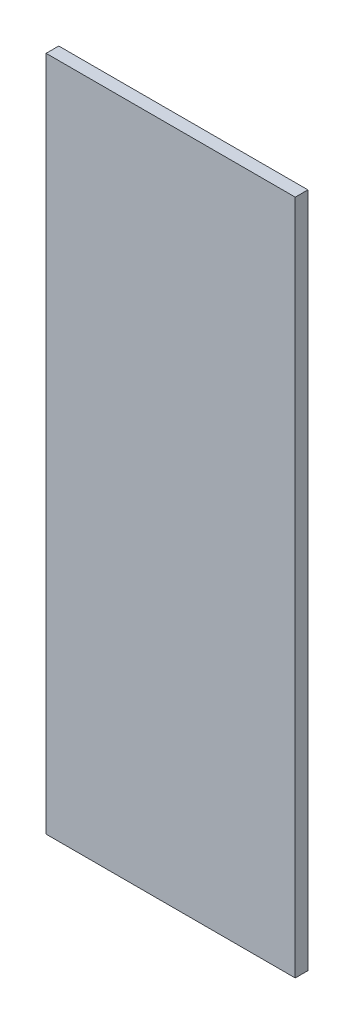
ISO-10303-21;
HEADER;
FILE_DESCRIPTION(('STEP AP214'),'2;1');
FILE_NAME('part.step','',(''),(''),'','','');
FILE_SCHEMA(('AUTOMOTIVE_DESIGN { 1 0 10303 214 1 1 1 1 }'));
ENDSEC;
DATA;
#1=APPLICATION_CONTEXT('core data for automotive mechanical design processes');
#2=APPLICATION_PROTOCOL_DEFINITION('international standard','automotive_design',2000,#1);
#3=PRODUCT_CONTEXT('',#1,'mechanical');
#4=PRODUCT('Part','Part','',(#3));
#5=PRODUCT_RELATED_PRODUCT_CATEGORY('part','',(#4));
#6=PRODUCT_DEFINITION_FORMATION('','',#4);
#7=PRODUCT_DEFINITION_CONTEXT('part definition',#1,'design');
#8=PRODUCT_DEFINITION('design','',#6,#7);
#9=PRODUCT_DEFINITION_SHAPE('','',#8);
#10=(LENGTH_UNIT() NAMED_UNIT(*) SI_UNIT(.MILLI.,.METRE.));
#11=(NAMED_UNIT(*) PLANE_ANGLE_UNIT() SI_UNIT($,.RADIAN.));
#12=(NAMED_UNIT(*) SI_UNIT($,.STERADIAN.) SOLID_ANGLE_UNIT());
#13=UNCERTAINTY_MEASURE_WITH_UNIT(LENGTH_MEASURE(1.E-05),#10,'distance_accuracy_value','');
#14=(GEOMETRIC_REPRESENTATION_CONTEXT(3) GLOBAL_UNCERTAINTY_ASSIGNED_CONTEXT((#13)) GLOBAL_UNIT_ASSIGNED_CONTEXT((#10,
#11,#12)) REPRESENTATION_CONTEXT('',''));
#15=CARTESIAN_POINT('',(0.,0.,0.));
#16=DIRECTION('',(0.,0.,1.));
#17=DIRECTION('',(1.,0.,0.));
#18=AXIS2_PLACEMENT_3D('',#15,#16,#17);
#19=CARTESIAN_POINT('',(92.9420013427735,53.8279991149902,0.));
#20=DIRECTION('',(1.,0.,0.));
#21=DIRECTION('',(0.,-1.,0.));
#22=AXIS2_PLACEMENT_3D('',#19,#20,#21);
#23=PLANE('',#22);
#24=DIRECTION('',(0.,-1.,0.));
#25=VECTOR('',#24,1.);
#26=CARTESIAN_POINT('',(92.9420013427734,53.8279991149902,0.03556));
#27=LINE('',#26,#25);
#28=CARTESIAN_POINT('',(92.9420013427734,53.8279991149902,0.03556));
#29=VERTEX_POINT('',#28);
#30=CARTESIAN_POINT('',(92.9420013427734,51.9280014038086,0.03556));
#31=VERTEX_POINT('',#30);
#32=EDGE_CURVE('E11',#29,#31,#27,.T.);
#33=ORIENTED_EDGE('',*,*,#32,.F.);
#34=DIRECTION('',(0.,0.,1.));
#35=VECTOR('',#34,1.);
#36=CARTESIAN_POINT('',(92.9420013427734,53.8279991149902,0.));
#37=LINE('',#36,#35);
#38=CARTESIAN_POINT('',(92.9420013427734,53.8279991149902,0.));
#39=VERTEX_POINT('',#38);
#40=EDGE_CURVE('E24',#39,#29,#37,.T.);
#41=ORIENTED_EDGE('',*,*,#40,.F.);
#42=DIRECTION('',(0.,-1.,0.));
#43=VECTOR('',#42,1.);
#44=CARTESIAN_POINT('',(92.9420013427734,53.8279991149902,0.));
#45=LINE('',#44,#43);
#46=CARTESIAN_POINT('',(92.9420013427734,51.9280014038086,0.));
#47=VERTEX_POINT('',#46);
#48=EDGE_CURVE('E75',#39,#47,#45,.T.);
#49=ORIENTED_EDGE('',*,*,#48,.T.);
#50=DIRECTION('',(0.,0.,1.));
#51=VECTOR('',#50,1.);
#52=CARTESIAN_POINT('',(92.9420013427734,51.9280014038086,0.));
#53=LINE('',#52,#51);
#54=EDGE_CURVE('E37',#47,#31,#53,.T.);
#55=ORIENTED_EDGE('',*,*,#54,.T.);
#56=EDGE_LOOP('',(#33,#41,#49,#55));
#57=FACE_BOUND('',#56,.T.);
#58=ADVANCED_FACE('F17',(#57),#23,.F.);
#59=CARTESIAN_POINT('',(92.9420013427735,51.9280014038086,0.));
#60=DIRECTION('',(0.,1.,0.));
#61=DIRECTION('',(1.,0.,0.));
#62=AXIS2_PLACEMENT_3D('',#59,#60,#61);
#63=PLANE('',#62);
#64=DIRECTION('',(1.,0.,0.));
#65=VECTOR('',#64,1.);
#66=CARTESIAN_POINT('',(92.9420013427734,51.9280014038086,0.03556));
#67=LINE('',#66,#65);
#68=CARTESIAN_POINT('',(93.6419982910156,51.9280014038086,0.03556));
#69=VERTEX_POINT('',#68);
#70=EDGE_CURVE('E83',#31,#69,#67,.T.);
#71=ORIENTED_EDGE('',*,*,#70,.F.);
#72=ORIENTED_EDGE('',*,*,#54,.F.);
#73=DIRECTION('',(1.,0.,0.));
#74=VECTOR('',#73,1.);
#75=CARTESIAN_POINT('',(92.9420013427734,51.9280014038086,0.));
#76=LINE('',#75,#74);
#77=CARTESIAN_POINT('',(93.6419982910156,51.9280014038086,0.));
#78=VERTEX_POINT('',#77);
#79=EDGE_CURVE('E81',#47,#78,#76,.T.);
#80=ORIENTED_EDGE('',*,*,#79,.T.);
#81=DIRECTION('',(0.,0.,1.));
#82=VECTOR('',#81,1.);
#83=CARTESIAN_POINT('',(93.6419982910156,51.9280014038086,0.));
#84=LINE('',#83,#82);
#85=EDGE_CURVE('E67',#78,#69,#84,.T.);
#86=ORIENTED_EDGE('',*,*,#85,.T.);
#87=EDGE_LOOP('',(#71,#72,#80,#86));
#88=FACE_BOUND('',#87,.T.);
#89=ADVANCED_FACE('F89',(#88),#63,.F.);
#90=CARTESIAN_POINT('',(93.6419982910156,51.9280014038086,0.));
#91=DIRECTION('',(-1.,0.,0.));
#92=DIRECTION('',(0.,1.,0.));
#93=AXIS2_PLACEMENT_3D('',#90,#91,#92);
#94=PLANE('',#93);
#95=DIRECTION('',(0.,1.,0.));
#96=VECTOR('',#95,1.);
#97=CARTESIAN_POINT('',(93.6419982910156,51.9280014038086,0.03556));
#98=LINE('',#97,#96);
#99=CARTESIAN_POINT('',(93.6419982910156,53.8279991149902,0.03556));
#100=VERTEX_POINT('',#99);
#101=EDGE_CURVE('E71',#69,#100,#98,.T.);
#102=ORIENTED_EDGE('',*,*,#101,.F.);
#103=ORIENTED_EDGE('',*,*,#85,.F.);
#104=DIRECTION('',(0.,1.,0.));
#105=VECTOR('',#104,1.);
#106=CARTESIAN_POINT('',(93.6419982910156,51.9280014038086,0.));
#107=LINE('',#106,#105);
#108=CARTESIAN_POINT('',(93.6419982910156,53.8279991149902,0.));
#109=VERTEX_POINT('',#108);
#110=EDGE_CURVE('E63',#78,#109,#107,.T.);
#111=ORIENTED_EDGE('',*,*,#110,.T.);
#112=DIRECTION('',(0.,0.,1.));
#113=VECTOR('',#112,1.);
#114=CARTESIAN_POINT('',(93.6419982910156,53.8279991149902,0.));
#115=LINE('',#114,#113);
#116=EDGE_CURVE('E53',#109,#100,#115,.T.);
#117=ORIENTED_EDGE('',*,*,#116,.T.);
#118=EDGE_LOOP('',(#102,#103,#111,#117));
#119=FACE_BOUND('',#118,.T.);
#120=ADVANCED_FACE('F66',(#119),#94,.F.);
#121=CARTESIAN_POINT('',(93.6419982910156,53.8279991149902,0.));
#122=DIRECTION('',(0.,-1.,0.));
#123=DIRECTION('',(-1.,0.,0.));
#124=AXIS2_PLACEMENT_3D('',#121,#122,#123);
#125=PLANE('',#124);
#126=DIRECTION('',(-1.,0.,0.));
#127=VECTOR('',#126,1.);
#128=CARTESIAN_POINT('',(93.6419982910156,53.8279991149902,0.03556));
#129=LINE('',#128,#127);
#130=EDGE_CURVE('E59',#100,#29,#129,.T.);
#131=ORIENTED_EDGE('',*,*,#130,.F.);
#132=ORIENTED_EDGE('',*,*,#116,.F.);
#133=DIRECTION('',(-1.,0.,0.));
#134=VECTOR('',#133,1.);
#135=CARTESIAN_POINT('',(93.6419982910156,53.8279991149902,0.));
#136=LINE('',#135,#134);
#137=EDGE_CURVE('E57',#109,#39,#136,.T.);
#138=ORIENTED_EDGE('',*,*,#137,.T.);
#139=ORIENTED_EDGE('',*,*,#40,.T.);
#140=EDGE_LOOP('',(#131,#132,#138,#139));
#141=FACE_BOUND('',#140,.T.);
#142=ADVANCED_FACE('F55',(#141),#125,.F.);
#143=CARTESIAN_POINT('',(92.9420013427735,53.8279991149902,0.));
#144=DIRECTION('',(0.,0.,-1.));
#145=DIRECTION('',(-1.,0.,0.));
#146=AXIS2_PLACEMENT_3D('',#143,#144,#145);
#147=PLANE('',#146);
#148=ORIENTED_EDGE('',*,*,#137,.F.);
#149=ORIENTED_EDGE('',*,*,#110,.F.);
#150=ORIENTED_EDGE('',*,*,#79,.F.);
#151=ORIENTED_EDGE('',*,*,#48,.F.);
#152=EDGE_LOOP('',(#148,#149,#150,#151));
#153=FACE_BOUND('',#152,.T.);
#154=ADVANCED_FACE('F74',(#153),#147,.T.);
#155=CARTESIAN_POINT('',(92.9420013427735,53.8279991149902,0.03556));
#156=DIRECTION('',(0.,0.,-1.));
#157=DIRECTION('',(-1.,0.,0.));
#158=AXIS2_PLACEMENT_3D('',#155,#156,#157);
#159=PLANE('',#158);
#160=ORIENTED_EDGE('',*,*,#32,.T.);
#161=ORIENTED_EDGE('',*,*,#70,.T.);
#162=ORIENTED_EDGE('',*,*,#101,.T.);
#163=ORIENTED_EDGE('',*,*,#130,.T.);
#164=EDGE_LOOP('',(#160,#161,#162,#163));
#165=FACE_BOUND('',#164,.T.);
#166=ADVANCED_FACE('F91',(#165),#159,.F.);
#167=CLOSED_SHELL('',(#58,#89,#120,#142,#154,#166));
#168=MANIFOLD_SOLID_BREP('B1',#167);
#169=ADVANCED_BREP_SHAPE_REPRESENTATION('',(#18,#168),#14);
#170=SHAPE_DEFINITION_REPRESENTATION(#9,#169);
ENDSEC;
END-ISO-10303-21;
